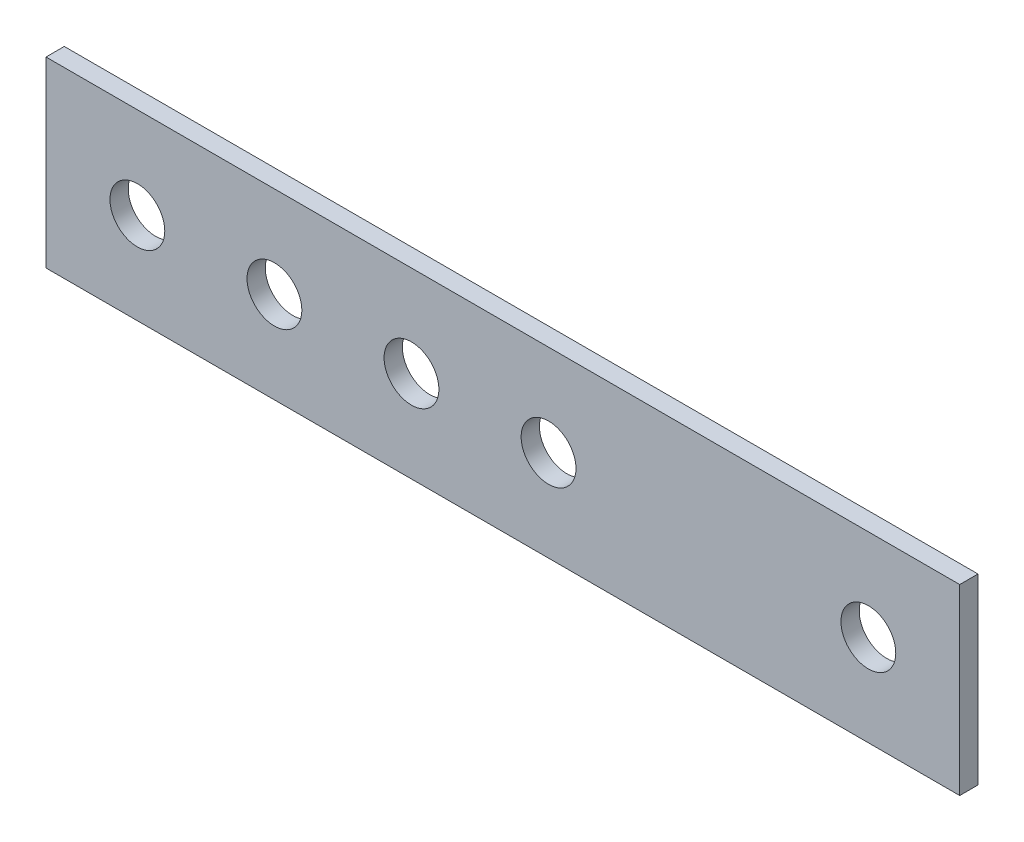
ISO-10303-21;
HEADER;
FILE_DESCRIPTION(('STEP AP214'),'2;1');
FILE_NAME('part.step','',(''),(''),'','','');
FILE_SCHEMA(('AUTOMOTIVE_DESIGN { 1 0 10303 214 1 1 1 1 }'));
ENDSEC;
DATA;
#1=APPLICATION_CONTEXT('core data for automotive mechanical design processes');
#2=APPLICATION_PROTOCOL_DEFINITION('international standard','automotive_design',2000,#1);
#3=PRODUCT_CONTEXT('',#1,'mechanical');
#4=PRODUCT('Part','Part','',(#3));
#5=PRODUCT_RELATED_PRODUCT_CATEGORY('part','',(#4));
#6=PRODUCT_DEFINITION_FORMATION('','',#4);
#7=PRODUCT_DEFINITION_CONTEXT('part definition',#1,'design');
#8=PRODUCT_DEFINITION('design','',#6,#7);
#9=PRODUCT_DEFINITION_SHAPE('','',#8);
#10=(LENGTH_UNIT() NAMED_UNIT(*) SI_UNIT(.MILLI.,.METRE.));
#11=(NAMED_UNIT(*) PLANE_ANGLE_UNIT() SI_UNIT($,.RADIAN.));
#12=(NAMED_UNIT(*) SI_UNIT($,.STERADIAN.) SOLID_ANGLE_UNIT());
#13=UNCERTAINTY_MEASURE_WITH_UNIT(LENGTH_MEASURE(1.E-05),#10,'distance_accuracy_value','');
#14=(GEOMETRIC_REPRESENTATION_CONTEXT(3) GLOBAL_UNCERTAINTY_ASSIGNED_CONTEXT((#13)) GLOBAL_UNIT_ASSIGNED_CONTEXT((#10,
#11,#12)) REPRESENTATION_CONTEXT('',''));
#15=CARTESIAN_POINT('',(0.,0.,0.));
#16=DIRECTION('',(0.,0.,1.));
#17=DIRECTION('',(1.,0.,0.));
#18=AXIS2_PLACEMENT_3D('',#15,#16,#17);
#19=CARTESIAN_POINT('',(9.99999999999997,0.,-2.));
#20=DIRECTION('',(0.,0.,1.));
#21=DIRECTION('',(1.,0.,0.));
#22=AXIS2_PLACEMENT_3D('',#19,#20,#21);
#23=CYLINDRICAL_SURFACE('',#22,6.);
#24=CARTESIAN_POINT('',(9.99999999999997,0.,-2.));
#25=DIRECTION('',(0.,0.,1.));
#26=DIRECTION('',(1.,0.,0.));
#27=AXIS2_PLACEMENT_3D('',#24,#25,#26);
#28=CIRCLE('',#27,6.);
#29=CARTESIAN_POINT('',(16.,0.,-2.));
#30=VERTEX_POINT('',#29);
#31=EDGE_CURVE('E41',#30,#30,#28,.T.);
#32=ORIENTED_EDGE('',*,*,#31,.F.);
#33=EDGE_LOOP('',(#32));
#34=FACE_BOUND('',#33,.T.);
#35=CARTESIAN_POINT('',(9.99999999999997,0.,2.));
#36=DIRECTION('',(0.,0.,1.));
#37=DIRECTION('',(1.,0.,0.));
#38=AXIS2_PLACEMENT_3D('',#35,#36,#37);
#39=CIRCLE('',#38,6.);
#40=CARTESIAN_POINT('',(16.,0.,2.));
#41=VERTEX_POINT('',#40);
#42=EDGE_CURVE('E11',#41,#41,#39,.T.);
#43=ORIENTED_EDGE('',*,*,#42,.T.);
#44=EDGE_LOOP('',(#43));
#45=FACE_BOUND('',#44,.T.);
#46=ADVANCED_FACE('F33',(#34,#45),#23,.F.);
#47=CARTESIAN_POINT('',(-20.,0.,-2.));
#48=DIRECTION('',(0.,0.,1.));
#49=DIRECTION('',(1.,0.,0.));
#50=AXIS2_PLACEMENT_3D('',#47,#48,#49);
#51=CYLINDRICAL_SURFACE('',#50,6.);
#52=CARTESIAN_POINT('',(-20.,0.,-2.));
#53=DIRECTION('',(0.,0.,1.));
#54=DIRECTION('',(1.,0.,0.));
#55=AXIS2_PLACEMENT_3D('',#52,#53,#54);
#56=CIRCLE('',#55,6.);
#57=CARTESIAN_POINT('',(-14.,0.,-2.));
#58=VERTEX_POINT('',#57);
#59=EDGE_CURVE('E111',#58,#58,#56,.T.);
#60=ORIENTED_EDGE('',*,*,#59,.F.);
#61=EDGE_LOOP('',(#60));
#62=FACE_BOUND('',#61,.T.);
#63=CARTESIAN_POINT('',(-20.,0.,2.));
#64=DIRECTION('',(0.,0.,1.));
#65=DIRECTION('',(1.,0.,0.));
#66=AXIS2_PLACEMENT_3D('',#63,#64,#65);
#67=CIRCLE('',#66,6.);
#68=CARTESIAN_POINT('',(-14.,0.,2.));
#69=VERTEX_POINT('',#68);
#70=EDGE_CURVE('E114',#69,#69,#67,.T.);
#71=ORIENTED_EDGE('',*,*,#70,.T.);
#72=EDGE_LOOP('',(#71));
#73=FACE_BOUND('',#72,.T.);
#74=ADVANCED_FACE('F123',(#62,#73),#51,.F.);
#75=CARTESIAN_POINT('',(0.,0.,2.));
#76=DIRECTION('',(0.,0.,1.));
#77=DIRECTION('',(1.,0.,0.));
#78=AXIS2_PLACEMENT_3D('',#75,#76,#77);
#79=PLANE('',#78);
#80=CARTESIAN_POINT('',(-50.,0.,2.));
#81=DIRECTION('',(0.,0.,1.));
#82=DIRECTION('',(1.,0.,0.));
#83=AXIS2_PLACEMENT_3D('',#80,#81,#82);
#84=CIRCLE('',#83,6.);
#85=CARTESIAN_POINT('',(-44.,0.,2.));
#86=VERTEX_POINT('',#85);
#87=EDGE_CURVE('E175',#86,#86,#84,.T.);
#88=ORIENTED_EDGE('',*,*,#87,.F.);
#89=EDGE_LOOP('',(#88));
#90=FACE_BOUND('',#89,.T.);
#91=CARTESIAN_POINT('',(-80.,0.,2.));
#92=DIRECTION('',(0.,0.,1.));
#93=DIRECTION('',(1.,0.,0.));
#94=AXIS2_PLACEMENT_3D('',#91,#92,#93);
#95=CIRCLE('',#94,6.);
#96=CARTESIAN_POINT('',(-74.,0.,2.));
#97=VERTEX_POINT('',#96);
#98=EDGE_CURVE('E171',#97,#97,#95,.T.);
#99=ORIENTED_EDGE('',*,*,#98,.F.);
#100=EDGE_LOOP('',(#99));
#101=FACE_BOUND('',#100,.T.);
#102=DIRECTION('',(0.,1.,0.));
#103=VECTOR('',#102,1.);
#104=CARTESIAN_POINT('',(100.,20.,2.));
#105=LINE('',#104,#103);
#106=CARTESIAN_POINT('',(100.,-20.,2.));
#107=VERTEX_POINT('',#106);
#108=CARTESIAN_POINT('',(100.,20.,2.));
#109=VERTEX_POINT('',#108);
#110=EDGE_CURVE('E86',#107,#109,#105,.T.);
#111=ORIENTED_EDGE('',*,*,#110,.T.);
#112=DIRECTION('',(-1.,0.,0.));
#113=VECTOR('',#112,1.);
#114=CARTESIAN_POINT('',(-100.,20.,2.));
#115=LINE('',#114,#113);
#116=CARTESIAN_POINT('',(-100.,20.,2.));
#117=VERTEX_POINT('',#116);
#118=EDGE_CURVE('E80',#109,#117,#115,.T.);
#119=ORIENTED_EDGE('',*,*,#118,.T.);
#120=DIRECTION('',(0.,-1.,0.));
#121=VECTOR('',#120,1.);
#122=CARTESIAN_POINT('',(-100.,20.,2.));
#123=LINE('',#122,#121);
#124=CARTESIAN_POINT('',(-100.,-20.,2.));
#125=VERTEX_POINT('',#124);
#126=EDGE_CURVE('E84',#117,#125,#123,.T.);
#127=ORIENTED_EDGE('',*,*,#126,.T.);
#128=DIRECTION('',(1.,0.,0.));
#129=VECTOR('',#128,1.);
#130=CARTESIAN_POINT('',(-100.,-20.,2.));
#131=LINE('',#130,#129);
#132=EDGE_CURVE('E49',#125,#107,#131,.T.);
#133=ORIENTED_EDGE('',*,*,#132,.T.);
#134=EDGE_LOOP('',(#111,#119,#127,#133));
#135=FACE_BOUND('',#134,.T.);
#136=CARTESIAN_POINT('',(80.,0.,2.));
#137=DIRECTION('',(0.,0.,1.));
#138=DIRECTION('',(1.,0.,0.));
#139=AXIS2_PLACEMENT_3D('',#136,#137,#138);
#140=CIRCLE('',#139,6.);
#141=CARTESIAN_POINT('',(86.,0.,2.));
#142=VERTEX_POINT('',#141);
#143=EDGE_CURVE('E104',#142,#142,#140,.T.);
#144=ORIENTED_EDGE('',*,*,#143,.F.);
#145=EDGE_LOOP('',(#144));
#146=FACE_BOUND('',#145,.T.);
#147=ORIENTED_EDGE('',*,*,#70,.F.);
#148=EDGE_LOOP('',(#147));
#149=FACE_BOUND('',#148,.T.);
#150=ORIENTED_EDGE('',*,*,#42,.F.);
#151=EDGE_LOOP('',(#150));
#152=FACE_BOUND('',#151,.T.);
#153=ADVANCED_FACE('F81',(#90,#101,#135,#146,#149,#152),#79,.T.);
#154=CARTESIAN_POINT('',(0.,0.,-2.));
#155=DIRECTION('',(0.,0.,1.));
#156=DIRECTION('',(1.,0.,0.));
#157=AXIS2_PLACEMENT_3D('',#154,#155,#156);
#158=PLANE('',#157);
#159=CARTESIAN_POINT('',(-50.,0.,-2.));
#160=DIRECTION('',(0.,0.,1.));
#161=DIRECTION('',(1.,0.,0.));
#162=AXIS2_PLACEMENT_3D('',#159,#160,#161);
#163=CIRCLE('',#162,6.);
#164=CARTESIAN_POINT('',(-44.,0.,-2.));
#165=VERTEX_POINT('',#164);
#166=EDGE_CURVE('E179',#165,#165,#163,.T.);
#167=ORIENTED_EDGE('',*,*,#166,.T.);
#168=EDGE_LOOP('',(#167));
#169=FACE_BOUND('',#168,.T.);
#170=CARTESIAN_POINT('',(-80.,0.,-2.));
#171=DIRECTION('',(0.,0.,1.));
#172=DIRECTION('',(1.,0.,0.));
#173=AXIS2_PLACEMENT_3D('',#170,#171,#172);
#174=CIRCLE('',#173,6.);
#175=CARTESIAN_POINT('',(-74.,0.,-2.));
#176=VERTEX_POINT('',#175);
#177=EDGE_CURVE('E166',#176,#176,#174,.T.);
#178=ORIENTED_EDGE('',*,*,#177,.T.);
#179=EDGE_LOOP('',(#178));
#180=FACE_BOUND('',#179,.T.);
#181=DIRECTION('',(0.,1.,0.));
#182=VECTOR('',#181,1.);
#183=CARTESIAN_POINT('',(100.,20.,-2.));
#184=LINE('',#183,#182);
#185=CARTESIAN_POINT('',(100.,-20.,-2.));
#186=VERTEX_POINT('',#185);
#187=CARTESIAN_POINT('',(100.,20.,-2.));
#188=VERTEX_POINT('',#187);
#189=EDGE_CURVE('E101',#186,#188,#184,.T.);
#190=ORIENTED_EDGE('',*,*,#189,.F.);
#191=DIRECTION('',(1.,0.,0.));
#192=VECTOR('',#191,1.);
#193=CARTESIAN_POINT('',(-100.,-20.,-2.));
#194=LINE('',#193,#192);
#195=CARTESIAN_POINT('',(-100.,-20.,-2.));
#196=VERTEX_POINT('',#195);
#197=EDGE_CURVE('E72',#196,#186,#194,.T.);
#198=ORIENTED_EDGE('',*,*,#197,.F.);
#199=DIRECTION('',(0.,-1.,0.));
#200=VECTOR('',#199,1.);
#201=CARTESIAN_POINT('',(-100.,20.,-2.));
#202=LINE('',#201,#200);
#203=CARTESIAN_POINT('',(-100.,20.,-2.));
#204=VERTEX_POINT('',#203);
#205=EDGE_CURVE('E66',#204,#196,#202,.T.);
#206=ORIENTED_EDGE('',*,*,#205,.F.);
#207=DIRECTION('',(-1.,0.,0.));
#208=VECTOR('',#207,1.);
#209=CARTESIAN_POINT('',(-100.,20.,-2.));
#210=LINE('',#209,#208);
#211=EDGE_CURVE('E91',#188,#204,#210,.T.);
#212=ORIENTED_EDGE('',*,*,#211,.F.);
#213=EDGE_LOOP('',(#190,#198,#206,#212));
#214=FACE_BOUND('',#213,.T.);
#215=CARTESIAN_POINT('',(80.,0.,-2.));
#216=DIRECTION('',(0.,0.,1.));
#217=DIRECTION('',(1.,0.,0.));
#218=AXIS2_PLACEMENT_3D('',#215,#216,#217);
#219=CIRCLE('',#218,6.);
#220=CARTESIAN_POINT('',(86.,0.,-2.));
#221=VERTEX_POINT('',#220);
#222=EDGE_CURVE('E160',#221,#221,#219,.T.);
#223=ORIENTED_EDGE('',*,*,#222,.T.);
#224=EDGE_LOOP('',(#223));
#225=FACE_BOUND('',#224,.T.);
#226=ORIENTED_EDGE('',*,*,#59,.T.);
#227=EDGE_LOOP('',(#226));
#228=FACE_BOUND('',#227,.T.);
#229=ORIENTED_EDGE('',*,*,#31,.T.);
#230=EDGE_LOOP('',(#229));
#231=FACE_BOUND('',#230,.T.);
#232=ADVANCED_FACE('F119',(#169,#180,#214,#225,#228,#231),#158,.F.);
#233=CARTESIAN_POINT('',(100.,20.,2.));
#234=DIRECTION('',(-1.,0.,0.));
#235=DIRECTION('',(0.,0.,1.));
#236=AXIS2_PLACEMENT_3D('',#233,#234,#235);
#237=PLANE('',#236);
#238=ORIENTED_EDGE('',*,*,#189,.T.);
#239=DIRECTION('',(0.,0.,-1.));
#240=VECTOR('',#239,1.);
#241=CARTESIAN_POINT('',(100.,20.,2.));
#242=LINE('',#241,#240);
#243=EDGE_CURVE('E92',#109,#188,#242,.T.);
#244=ORIENTED_EDGE('',*,*,#243,.F.);
#245=ORIENTED_EDGE('',*,*,#110,.F.);
#246=DIRECTION('',(0.,0.,-1.));
#247=VECTOR('',#246,1.);
#248=CARTESIAN_POINT('',(100.,-20.,2.));
#249=LINE('',#248,#247);
#250=EDGE_CURVE('E97',#107,#186,#249,.T.);
#251=ORIENTED_EDGE('',*,*,#250,.T.);
#252=EDGE_LOOP('',(#238,#244,#245,#251));
#253=FACE_BOUND('',#252,.T.);
#254=ADVANCED_FACE('F133',(#253),#237,.F.);
#255=CARTESIAN_POINT('',(-100.,20.,2.));
#256=DIRECTION('',(0.,-1.,0.));
#257=DIRECTION('',(0.,0.,-1.));
#258=AXIS2_PLACEMENT_3D('',#255,#256,#257);
#259=PLANE('',#258);
#260=ORIENTED_EDGE('',*,*,#211,.T.);
#261=DIRECTION('',(0.,0.,-1.));
#262=VECTOR('',#261,1.);
#263=CARTESIAN_POINT('',(-100.,20.,2.));
#264=LINE('',#263,#262);
#265=EDGE_CURVE('E89',#117,#204,#264,.T.);
#266=ORIENTED_EDGE('',*,*,#265,.F.);
#267=ORIENTED_EDGE('',*,*,#118,.F.);
#268=ORIENTED_EDGE('',*,*,#243,.T.);
#269=EDGE_LOOP('',(#260,#266,#267,#268));
#270=FACE_BOUND('',#269,.T.);
#271=ADVANCED_FACE('F90',(#270),#259,.F.);
#272=CARTESIAN_POINT('',(-100.,20.,2.));
#273=DIRECTION('',(1.,0.,0.));
#274=DIRECTION('',(0.,0.,-1.));
#275=AXIS2_PLACEMENT_3D('',#272,#273,#274);
#276=PLANE('',#275);
#277=ORIENTED_EDGE('',*,*,#205,.T.);
#278=DIRECTION('',(0.,0.,-1.));
#279=VECTOR('',#278,1.);
#280=CARTESIAN_POINT('',(-100.,-20.,2.));
#281=LINE('',#280,#279);
#282=EDGE_CURVE('E93',#125,#196,#281,.T.);
#283=ORIENTED_EDGE('',*,*,#282,.F.);
#284=ORIENTED_EDGE('',*,*,#126,.F.);
#285=ORIENTED_EDGE('',*,*,#265,.T.);
#286=EDGE_LOOP('',(#277,#283,#284,#285));
#287=FACE_BOUND('',#286,.T.);
#288=ADVANCED_FACE('F95',(#287),#276,.F.);
#289=CARTESIAN_POINT('',(-100.,-20.,2.));
#290=DIRECTION('',(0.,1.,0.));
#291=DIRECTION('',(0.,0.,1.));
#292=AXIS2_PLACEMENT_3D('',#289,#290,#291);
#293=PLANE('',#292);
#294=ORIENTED_EDGE('',*,*,#197,.T.);
#295=ORIENTED_EDGE('',*,*,#250,.F.);
#296=ORIENTED_EDGE('',*,*,#132,.F.);
#297=ORIENTED_EDGE('',*,*,#282,.T.);
#298=EDGE_LOOP('',(#294,#295,#296,#297));
#299=FACE_BOUND('',#298,.T.);
#300=ADVANCED_FACE('F143',(#299),#293,.F.);
#301=CARTESIAN_POINT('',(80.,0.,2.));
#302=DIRECTION('',(0.,0.,-1.));
#303=DIRECTION('',(-1.,0.,0.));
#304=AXIS2_PLACEMENT_3D('',#301,#302,#303);
#305=CYLINDRICAL_SURFACE('',#304,6.);
#306=ORIENTED_EDGE('',*,*,#143,.T.);
#307=EDGE_LOOP('',(#306));
#308=FACE_BOUND('',#307,.T.);
#309=ORIENTED_EDGE('',*,*,#222,.F.);
#310=EDGE_LOOP('',(#309));
#311=FACE_BOUND('',#310,.T.);
#312=ADVANCED_FACE('F140',(#308,#311),#305,.F.);
#313=CARTESIAN_POINT('',(-80.,0.,-2.));
#314=DIRECTION('',(0.,0.,1.));
#315=DIRECTION('',(1.,0.,0.));
#316=AXIS2_PLACEMENT_3D('',#313,#314,#315);
#317=CYLINDRICAL_SURFACE('',#316,6.);
#318=ORIENTED_EDGE('',*,*,#177,.F.);
#319=EDGE_LOOP('',(#318));
#320=FACE_BOUND('',#319,.T.);
#321=ORIENTED_EDGE('',*,*,#98,.T.);
#322=EDGE_LOOP('',(#321));
#323=FACE_BOUND('',#322,.T.);
#324=ADVANCED_FACE('F187',(#320,#323),#317,.F.);
#325=CARTESIAN_POINT('',(-50.,0.,-2.));
#326=DIRECTION('',(0.,0.,1.));
#327=DIRECTION('',(1.,0.,0.));
#328=AXIS2_PLACEMENT_3D('',#325,#326,#327);
#329=CYLINDRICAL_SURFACE('',#328,6.);
#330=ORIENTED_EDGE('',*,*,#166,.F.);
#331=EDGE_LOOP('',(#330));
#332=FACE_BOUND('',#331,.T.);
#333=ORIENTED_EDGE('',*,*,#87,.T.);
#334=EDGE_LOOP('',(#333));
#335=FACE_BOUND('',#334,.T.);
#336=ADVANCED_FACE('F184',(#332,#335),#329,.F.);
#337=CLOSED_SHELL('',(#46,#74,#153,#232,#254,#271,#288,#300,#312,#324,#336));
#338=MANIFOLD_SOLID_BREP('B2',#337);
#339=ADVANCED_BREP_SHAPE_REPRESENTATION('',(#18,#338),#14);
#340=SHAPE_DEFINITION_REPRESENTATION(#9,#339);
ENDSEC;
END-ISO-10303-21;
